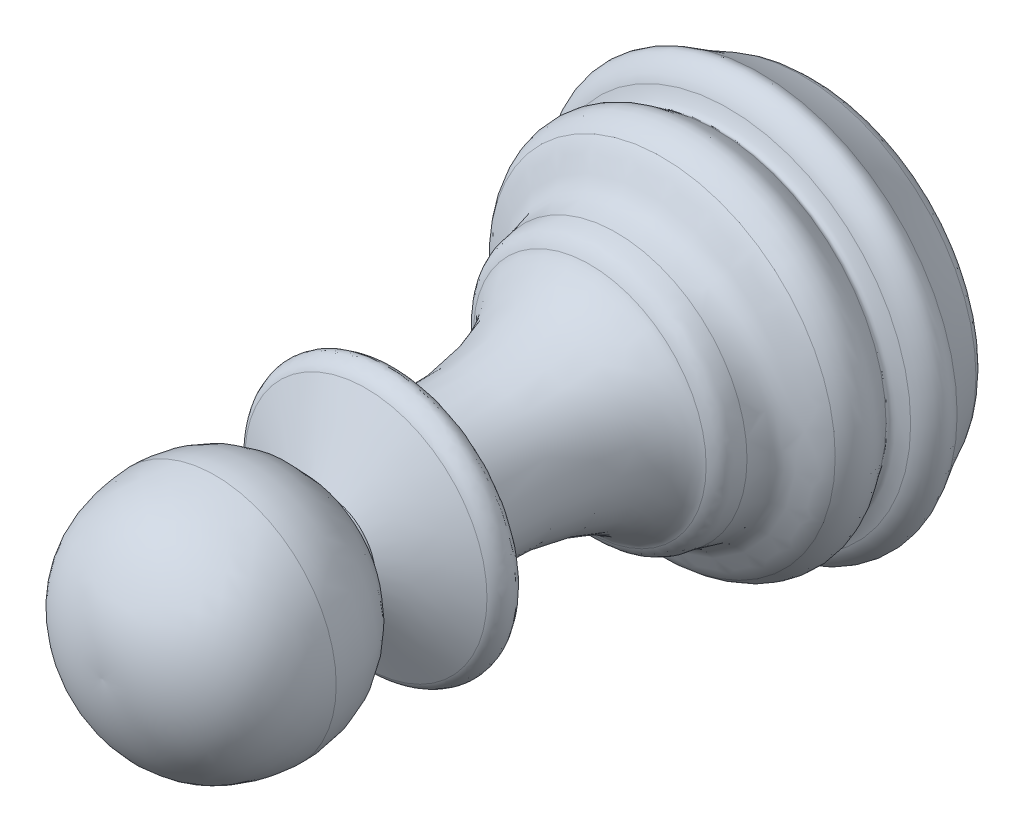
ISO-10303-21;
HEADER;
FILE_DESCRIPTION(('STEP AP214'),'2;1');
FILE_NAME('part.step','',(''),(''),'','','');
FILE_SCHEMA(('AUTOMOTIVE_DESIGN { 1 0 10303 214 1 1 1 1 }'));
ENDSEC;
DATA;
#1=APPLICATION_CONTEXT('core data for automotive mechanical design processes');
#2=APPLICATION_PROTOCOL_DEFINITION('international standard','automotive_design',2000,#1);
#3=PRODUCT_CONTEXT('',#1,'mechanical');
#4=PRODUCT('Part','Part','',(#3));
#5=PRODUCT_RELATED_PRODUCT_CATEGORY('part','',(#4));
#6=PRODUCT_DEFINITION_FORMATION('','',#4);
#7=PRODUCT_DEFINITION_CONTEXT('part definition',#1,'design');
#8=PRODUCT_DEFINITION('design','',#6,#7);
#9=PRODUCT_DEFINITION_SHAPE('','',#8);
#10=(LENGTH_UNIT() NAMED_UNIT(*) SI_UNIT(.MILLI.,.METRE.));
#11=(NAMED_UNIT(*) PLANE_ANGLE_UNIT() SI_UNIT($,.RADIAN.));
#12=(NAMED_UNIT(*) SI_UNIT($,.STERADIAN.) SOLID_ANGLE_UNIT());
#13=UNCERTAINTY_MEASURE_WITH_UNIT(LENGTH_MEASURE(1.E-05),#10,'distance_accuracy_value','');
#14=(GEOMETRIC_REPRESENTATION_CONTEXT(3) GLOBAL_UNCERTAINTY_ASSIGNED_CONTEXT((#13)) GLOBAL_UNIT_ASSIGNED_CONTEXT((#10,
#11,#12)) REPRESENTATION_CONTEXT('',''));
#15=CARTESIAN_POINT('',(0.,0.,0.));
#16=DIRECTION('',(0.,0.,1.));
#17=DIRECTION('',(1.,0.,0.));
#18=AXIS2_PLACEMENT_3D('',#15,#16,#17);
#19=CARTESIAN_POINT('',(0.,0.,0.));
#20=DIRECTION('',(0.,0.,1.));
#21=DIRECTION('',(1.,0.,0.));
#22=AXIS2_PLACEMENT_3D('',#19,#20,#21);
#23=PLANE('',#22);
#24=CARTESIAN_POINT('',(0.,0.,0.));
#25=DIRECTION('',(0.,0.,1.));
#26=DIRECTION('',(1.,0.,0.));
#27=AXIS2_PLACEMENT_3D('',#24,#25,#26);
#28=CIRCLE('',#27,5.54380540900091);
#29=CARTESIAN_POINT('',(5.54380540900091,0.,0.));
#30=VERTEX_POINT('',#29);
#31=EDGE_CURVE('E89',#30,#30,#28,.T.);
#32=ORIENTED_EDGE('',*,*,#31,.F.);
#33=EDGE_LOOP('',(#32));
#34=FACE_BOUND('',#33,.T.);
#35=ADVANCED_FACE('F33',(#34),#23,.F.);
#36=CARTESIAN_POINT('',(0.,-5.54380540900091,0.));
#37=CARTESIAN_POINT('',(0.,-6.88930220512461,0.686287117591929));
#38=CARTESIAN_POINT('',(0.,-6.31979329640109,1.52584767701262));
#39=B_SPLINE_CURVE_WITH_KNOTS('',2,(#36,#37,#38),.UNSPECIFIED.,.F.,.F.,(3,3),(0.,1.),.UNSPECIFIED.);
#40=CARTESIAN_POINT('',(0.,0.,26.6250714661388));
#41=DIRECTION('',(0.,0.,1.));
#42=AXIS1_PLACEMENT('',#40,#41);
#43=SURFACE_OF_REVOLUTION('',#39,#42);
#44=CARTESIAN_POINT('',(0.,0.,0.741248163644646));
#45=DIRECTION('',(0.,0.,1.));
#46=DIRECTION('',(1.,0.,0.));
#47=AXIS2_PLACEMENT_3D('',#44,#45,#46);
#48=CIRCLE('',#47,6.41877803695931);
#49=CARTESIAN_POINT('',(6.41877803695931,0.,0.741248163644646));
#50=VERTEX_POINT('',#49);
#51=EDGE_CURVE('E11',#50,#50,#48,.F.);
#52=ORIENTED_EDGE('',*,*,#51,.T.);
#53=EDGE_LOOP('',(#52));
#54=FACE_BOUND('',#53,.T.);
#55=ORIENTED_EDGE('',*,*,#31,.T.);
#56=EDGE_LOOP('',(#55));
#57=FACE_BOUND('',#56,.T.);
#58=ADVANCED_FACE('F103',(#54,#57),#43,.T.);
#59=CARTESIAN_POINT('',(0.,-7.08530775393653,2.05559233845546));
#60=CARTESIAN_POINT('',(0.,-7.5394105595259,2.52005985615532));
#61=CARTESIAN_POINT('',(0.,-7.40122549000943,3.03910509027459));
#62=CARTESIAN_POINT('',(0.,-6.97071058936282,3.39104928563491));
#63=CARTESIAN_POINT('',(0.,-6.74136266093906,3.4784528915882));
#64=B_SPLINE_CURVE_WITH_KNOTS('',3,(#59,#60,#61,#62,#63),.UNSPECIFIED.,.F.,.F.,(4,1,4),(0.,
0.627277691643805,1.),.UNSPECIFIED.);
#65=CARTESIAN_POINT('',(0.,0.,26.6250714661388));
#66=DIRECTION('',(0.,0.,1.));
#67=AXIS1_PLACEMENT('',#65,#66);
#68=SURFACE_OF_REVOLUTION('',#64,#67);
#69=CARTESIAN_POINT('',(0.,0.,2.30597722885203));
#70=DIRECTION('',(0.,0.,1.));
#71=DIRECTION('',(1.,0.,0.));
#72=AXIS2_PLACEMENT_3D('',#69,#70,#71);
#73=CIRCLE('',#72,7.28861300832227);
#74=CARTESIAN_POINT('',(7.28861300832227,0.,2.30597722885203));
#75=VERTEX_POINT('',#74);
#76=EDGE_CURVE('E40',#75,#75,#73,.T.);
#77=ORIENTED_EDGE('',*,*,#76,.T.);
#78=EDGE_LOOP('',(#77));
#79=FACE_BOUND('',#78,.T.);
#80=CARTESIAN_POINT('',(0.,0.,3.4784528915882));
#81=DIRECTION('',(0.,0.,1.));
#82=DIRECTION('',(1.,0.,0.));
#83=AXIS2_PLACEMENT_3D('',#80,#81,#82);
#84=CIRCLE('',#83,6.74136266093906);
#85=CARTESIAN_POINT('',(6.74136266093906,0.,3.4784528915882));
#86=VERTEX_POINT('',#85);
#87=EDGE_CURVE('E86',#86,#86,#84,.T.);
#88=ORIENTED_EDGE('',*,*,#87,.F.);
#89=EDGE_LOOP('',(#88));
#90=FACE_BOUND('',#89,.T.);
#91=ADVANCED_FACE('F94',(#79,#90),#68,.T.);
#92=CARTESIAN_POINT('',(0.,-6.74136266093906,3.4784528915882));
#93=CARTESIAN_POINT('',(0.,-6.69003413724891,3.4980139928792));
#94=CARTESIAN_POINT('',(0.,-6.44510057926217,3.57334142751363));
#95=CARTESIAN_POINT('',(0.,-6.18394133438702,3.71775467280206));
#96=CARTESIAN_POINT('',(0.,-6.21872337618383,3.85525833890696));
#97=CARTESIAN_POINT('',(0.,-6.2477493248012,3.8978605653888));
#98=B_SPLINE_CURVE_WITH_KNOTS('',3,(#92,#93,#94,#95,#96,#97),.UNSPECIFIED.,.F.,.F.,(4,1,1,4),
(0.,0.415653946765478,0.837633487147216,1.),.UNSPECIFIED.);
#99=CARTESIAN_POINT('',(0.,0.,26.6250714661388));
#100=DIRECTION('',(0.,0.,1.));
#101=AXIS1_PLACEMENT('',#99,#100);
#102=SURFACE_OF_REVOLUTION('',#98,#101);
#103=CARTESIAN_POINT('',(0.,0.,3.8978605653888));
#104=DIRECTION('',(0.,0.,1.));
#105=DIRECTION('',(1.,0.,0.));
#106=AXIS2_PLACEMENT_3D('',#103,#104,#105);
#107=CIRCLE('',#106,6.2477493248012);
#108=CARTESIAN_POINT('',(6.2477493248012,0.,3.8978605653888));
#109=VERTEX_POINT('',#108);
#110=EDGE_CURVE('E83',#109,#109,#107,.T.);
#111=ORIENTED_EDGE('',*,*,#110,.F.);
#112=EDGE_LOOP('',(#111));
#113=FACE_BOUND('',#112,.T.);
#114=ORIENTED_EDGE('',*,*,#87,.T.);
#115=EDGE_LOOP('',(#114));
#116=FACE_BOUND('',#115,.T.);
#117=ADVANCED_FACE('F139',(#113,#116),#102,.T.);
#118=CARTESIAN_POINT('',(0.,-6.2477493248012,3.8978605653888));
#119=CARTESIAN_POINT('',(0.,-6.42633458869202,4.15997533582711));
#120=CARTESIAN_POINT('',(0.,-6.95166145899549,4.72818720175668));
#121=CARTESIAN_POINT('',(0.,-6.78417767732987,5.53134390215841));
#122=CARTESIAN_POINT('',(0.,-6.40240179389252,5.93019073502738));
#123=B_SPLINE_CURVE_WITH_KNOTS('',3,(#118,#119,#120,#121,#122),.UNSPECIFIED.,.F.,.F.,(4,1,4),
(0.,0.411498427605865,1.),.UNSPECIFIED.);
#124=CARTESIAN_POINT('',(0.,0.,26.6250714661388));
#125=DIRECTION('',(0.,0.,1.));
#126=AXIS1_PLACEMENT('',#124,#125);
#127=SURFACE_OF_REVOLUTION('',#123,#126);
#128=CARTESIAN_POINT('',(0.,0.,5.93019073502738));
#129=DIRECTION('',(0.,0.,1.));
#130=DIRECTION('',(1.,0.,0.));
#131=AXIS2_PLACEMENT_3D('',#128,#129,#130);
#132=CIRCLE('',#131,6.40240179389252);
#133=CARTESIAN_POINT('',(6.40240179389252,0.,5.93019073502738));
#134=VERTEX_POINT('',#133);
#135=EDGE_CURVE('E80',#134,#134,#132,.T.);
#136=ORIENTED_EDGE('',*,*,#135,.F.);
#137=EDGE_LOOP('',(#136));
#138=FACE_BOUND('',#137,.T.);
#139=ORIENTED_EDGE('',*,*,#110,.T.);
#140=EDGE_LOOP('',(#139));
#141=FACE_BOUND('',#140,.T.);
#142=ADVANCED_FACE('F142',(#138,#141),#127,.T.);
#143=CARTESIAN_POINT('',(0.,-6.40240179389252,5.93019073502738));
#144=CARTESIAN_POINT('',(0.,-6.00702161096956,6.34325017796062));
#145=CARTESIAN_POINT('',(0.,-5.10904880247781,6.44918911727253));
#146=CARTESIAN_POINT('',(0.,-4.87471836286527,7.30367231987795));
#147=CARTESIAN_POINT('',(0.,-4.83396756140255,7.62524934257052));
#148=B_SPLINE_CURVE_WITH_KNOTS('',3,(#143,#144,#145,#146,#147),.UNSPECIFIED.,.F.,.F.,(4,1,4),
(0.,0.622355002363214,1.),.UNSPECIFIED.);
#149=CARTESIAN_POINT('',(0.,0.,26.6250714661388));
#150=DIRECTION('',(0.,0.,1.));
#151=AXIS1_PLACEMENT('',#149,#150);
#152=SURFACE_OF_REVOLUTION('',#148,#151);
#153=CARTESIAN_POINT('',(0.,0.,7.62524934257052));
#154=DIRECTION('',(0.,0.,1.));
#155=DIRECTION('',(1.,0.,0.));
#156=AXIS2_PLACEMENT_3D('',#153,#154,#155);
#157=CIRCLE('',#156,4.83396756140255);
#158=CARTESIAN_POINT('',(4.83396756140255,0.,7.62524934257052));
#159=VERTEX_POINT('',#158);
#160=EDGE_CURVE('E77',#159,#159,#157,.T.);
#161=ORIENTED_EDGE('',*,*,#160,.F.);
#162=EDGE_LOOP('',(#161));
#163=FACE_BOUND('',#162,.T.);
#164=ORIENTED_EDGE('',*,*,#135,.T.);
#165=EDGE_LOOP('',(#164));
#166=FACE_BOUND('',#165,.T.);
#167=ADVANCED_FACE('F146',(#163,#166),#152,.T.);
#168=CARTESIAN_POINT('',(0.,-4.83396756140255,7.62524934257052));
#169=CARTESIAN_POINT('',(0.,-4.79990028539568,7.89408462424114));
#170=CARTESIAN_POINT('',(0.,-4.77873853692175,8.27593085338218));
#171=CARTESIAN_POINT('',(0.,-4.4596526335504,8.52480310345291));
#172=CARTESIAN_POINT('',(0.,-4.30193153105819,8.60490251250283));
#173=B_SPLINE_CURVE_WITH_KNOTS('',3,(#168,#169,#170,#171,#172),.UNSPECIFIED.,.F.,.F.,(4,1,4),
(0.,0.591594304790621,1.),.UNSPECIFIED.);
#174=CARTESIAN_POINT('',(0.,0.,26.6250714661388));
#175=DIRECTION('',(0.,0.,1.));
#176=AXIS1_PLACEMENT('',#174,#175);
#177=SURFACE_OF_REVOLUTION('',#173,#176);
#178=CARTESIAN_POINT('',(0.,0.,8.60490251250283));
#179=DIRECTION('',(0.,0.,1.));
#180=DIRECTION('',(1.,0.,0.));
#181=AXIS2_PLACEMENT_3D('',#178,#179,#180);
#182=CIRCLE('',#181,4.30193153105819);
#183=CARTESIAN_POINT('',(4.30193153105819,0.,8.60490251250283));
#184=VERTEX_POINT('',#183);
#185=EDGE_CURVE('E74',#184,#184,#182,.T.);
#186=ORIENTED_EDGE('',*,*,#185,.F.);
#187=EDGE_LOOP('',(#186));
#188=FACE_BOUND('',#187,.T.);
#189=ORIENTED_EDGE('',*,*,#160,.T.);
#190=EDGE_LOOP('',(#189));
#191=FACE_BOUND('',#190,.T.);
#192=ADVANCED_FACE('F150',(#188,#191),#177,.T.);
#193=CARTESIAN_POINT('',(0.,-4.30193153105819,8.60490251250283));
#194=CARTESIAN_POINT('',(0.,-3.71613185929674,8.90240365083052));
#195=CARTESIAN_POINT('',(0.,-2.13635684011027,11.1362757648571));
#196=CARTESIAN_POINT('',(0.,-2.73585294150847,15.6896951188552));
#197=B_SPLINE_CURVE_WITH_KNOTS('',3,(#193,#194,#195,#196),.UNSPECIFIED.,.F.,.F.,(4,4),(0.,1.),.UNSPECIFIED.);
#198=CARTESIAN_POINT('',(0.,0.,26.6250714661388));
#199=DIRECTION('',(0.,0.,1.));
#200=AXIS1_PLACEMENT('',#198,#199);
#201=SURFACE_OF_REVOLUTION('',#197,#200);
#202=CARTESIAN_POINT('',(0.,0.,15.6896951188552));
#203=DIRECTION('',(0.,0.,1.));
#204=DIRECTION('',(1.,0.,0.));
#205=AXIS2_PLACEMENT_3D('',#202,#203,#204);
#206=CIRCLE('',#205,2.73585294150847);
#207=CARTESIAN_POINT('',(2.73585294150847,0.,15.6896951188552));
#208=VERTEX_POINT('',#207);
#209=EDGE_CURVE('E71',#208,#208,#206,.T.);
#210=ORIENTED_EDGE('',*,*,#209,.F.);
#211=EDGE_LOOP('',(#210));
#212=FACE_BOUND('',#211,.T.);
#213=ORIENTED_EDGE('',*,*,#185,.T.);
#214=EDGE_LOOP('',(#213));
#215=FACE_BOUND('',#214,.T.);
#216=ADVANCED_FACE('F177',(#212,#215),#201,.T.);
#217=CARTESIAN_POINT('',(0.,-4.14677425575863,15.6896951188552));
#218=DIRECTION('',(0.,0.,1.));
#219=DIRECTION('',(1.,0.,0.));
#220=AXIS2_PLACEMENT_3D('',#217,#218,#219);
#221=PLANE('',#220);
#222=CARTESIAN_POINT('',(0.,0.,15.6896951188552));
#223=DIRECTION('',(0.,0.,1.));
#224=DIRECTION('',(1.,0.,0.));
#225=AXIS2_PLACEMENT_3D('',#222,#223,#224);
#226=CIRCLE('',#225,4.14677425575863);
#227=CARTESIAN_POINT('',(4.14677425575863,0.,15.6896951188552));
#228=VERTEX_POINT('',#227);
#229=EDGE_CURVE('E68',#228,#228,#226,.T.);
#230=ORIENTED_EDGE('',*,*,#229,.F.);
#231=EDGE_LOOP('',(#230));
#232=FACE_BOUND('',#231,.T.);
#233=ORIENTED_EDGE('',*,*,#209,.T.);
#234=EDGE_LOOP('',(#233));
#235=FACE_BOUND('',#234,.T.);
#236=ADVANCED_FACE('F180',(#232,#235),#221,.F.);
#237=CARTESIAN_POINT('',(0.,-4.14677425575863,15.6896951188552));
#238=CARTESIAN_POINT('',(0.,-4.49349374576997,15.6896951188552));
#239=CARTESIAN_POINT('',(0.,-5.06720298584773,16.1640499555581));
#240=CARTESIAN_POINT('',(0.,-4.67949812577122,16.786031006644));
#241=CARTESIAN_POINT('',(0.,-4.47900137598499,16.8884423972514));
#242=B_SPLINE_CURVE_WITH_KNOTS('',3,(#237,#238,#239,#240,#241),.UNSPECIFIED.,.F.,.F.,(4,1,4),
(0.,0.552532558306121,1.),.UNSPECIFIED.);
#243=CARTESIAN_POINT('',(0.,0.,26.6250714661388));
#244=DIRECTION('',(0.,0.,1.));
#245=AXIS1_PLACEMENT('',#243,#244);
#246=SURFACE_OF_REVOLUTION('',#242,#245);
#247=CARTESIAN_POINT('',(0.,0.,16.8884423972514));
#248=DIRECTION('',(0.,0.,1.));
#249=DIRECTION('',(1.,0.,0.));
#250=AXIS2_PLACEMENT_3D('',#247,#248,#249);
#251=CIRCLE('',#250,4.47900137598499);
#252=CARTESIAN_POINT('',(4.47900137598499,0.,16.8884423972514));
#253=VERTEX_POINT('',#252);
#254=EDGE_CURVE('E65',#253,#253,#251,.T.);
#255=ORIENTED_EDGE('',*,*,#254,.F.);
#256=EDGE_LOOP('',(#255));
#257=FACE_BOUND('',#256,.T.);
#258=ORIENTED_EDGE('',*,*,#229,.T.);
#259=EDGE_LOOP('',(#258));
#260=FACE_BOUND('',#259,.T.);
#261=ADVANCED_FACE('F184',(#257,#260),#246,.T.);
#262=CARTESIAN_POINT('',(0.,0.,16.8884423972514));
#263=DIRECTION('',(0.,0.,-1.));
#264=DIRECTION('',(-1.,0.,0.));
#265=AXIS2_PLACEMENT_3D('',#262,#263,#264);
#266=CONICAL_SURFACE('',#265,4.47900137598499,1.09855538660732);
#267=CARTESIAN_POINT('',(0.,0.,18.2828964989648));
#268=DIRECTION('',(0.,0.,1.));
#269=DIRECTION('',(1.,0.,0.));
#270=AXIS2_PLACEMENT_3D('',#267,#268,#269);
#271=CIRCLE('',#270,1.74899728697379);
#272=CARTESIAN_POINT('',(1.74899728697379,0.,18.2828964989648));
#273=VERTEX_POINT('',#272);
#274=EDGE_CURVE('E55',#273,#273,#271,.T.);
#275=ORIENTED_EDGE('',*,*,#274,.F.);
#276=EDGE_LOOP('',(#275));
#277=FACE_BOUND('',#276,.T.);
#278=ORIENTED_EDGE('',*,*,#254,.T.);
#279=EDGE_LOOP('',(#278));
#280=FACE_BOUND('',#279,.T.);
#281=ADVANCED_FACE('F188',(#277,#280),#266,.T.);
#282=CARTESIAN_POINT('',(0.,0.,26.6250714661388));
#283=DIRECTION('',(0.,0.,1.));
#284=DIRECTION('',(1.,0.,0.));
#285=AXIS2_PLACEMENT_3D('',#282,#283,#284);
#286=CYLINDRICAL_SURFACE('',#285,1.74899728697378);
#287=CARTESIAN_POINT('',(0.,0.,18.5191006817314));
#288=DIRECTION('',(0.,0.,1.));
#289=DIRECTION('',(1.,0.,0.));
#290=AXIS2_PLACEMENT_3D('',#287,#288,#289);
#291=CIRCLE('',#290,1.74899728697378);
#292=CARTESIAN_POINT('',(1.74899728697378,0.,18.5191006817314));
#293=VERTEX_POINT('',#292);
#294=EDGE_CURVE('E52',#293,#293,#291,.T.);
#295=ORIENTED_EDGE('',*,*,#294,.F.);
#296=EDGE_LOOP('',(#295));
#297=FACE_BOUND('',#296,.T.);
#298=ORIENTED_EDGE('',*,*,#274,.T.);
#299=EDGE_LOOP('',(#298));
#300=FACE_BOUND('',#299,.T.);
#301=ADVANCED_FACE('F192',(#297,#300),#286,.T.);
#302=CARTESIAN_POINT('',(0.,-1.74899728697378,18.5191006817314));
#303=CARTESIAN_POINT('',(0.,-4.4933357437564,19.72471462376));
#304=CARTESIAN_POINT('',(0.,-4.47900137598499,22.4655527855376));
#305=B_SPLINE_CURVE_WITH_KNOTS('',2,(#302,#303,#304),.UNSPECIFIED.,.F.,.F.,(3,3),(0.,1.),.UNSPECIFIED.);
#306=CARTESIAN_POINT('',(0.,0.,26.6250714661388));
#307=DIRECTION('',(0.,0.,1.));
#308=AXIS1_PLACEMENT('',#306,#307);
#309=SURFACE_OF_REVOLUTION('',#305,#308);
#310=CARTESIAN_POINT('',(0.,0.,22.4655527855376));
#311=DIRECTION('',(0.,0.,1.));
#312=DIRECTION('',(1.,0.,0.));
#313=AXIS2_PLACEMENT_3D('',#310,#311,#312);
#314=CIRCLE('',#313,4.479001375985);
#315=CARTESIAN_POINT('',(4.479001375985,0.,22.4655527855376));
#316=VERTEX_POINT('',#315);
#317=EDGE_CURVE('E50',#316,#316,#314,.T.);
#318=ORIENTED_EDGE('',*,*,#317,.F.);
#319=EDGE_LOOP('',(#318));
#320=FACE_BOUND('',#319,.T.);
#321=ORIENTED_EDGE('',*,*,#294,.T.);
#322=EDGE_LOOP('',(#321));
#323=FACE_BOUND('',#322,.T.);
#324=ADVANCED_FACE('F46',(#320,#323),#309,.T.);
#325=CARTESIAN_POINT('',(0.,-4.479001375985,22.4655527855376));
#326=CARTESIAN_POINT('',(0.,-4.41056249113169,23.5672746561115));
#327=CARTESIAN_POINT('',(0.,-3.7808345901192,25.7024440899064));
#328=CARTESIAN_POINT('',(0.,-1.26198279921926,26.7204481232485));
#329=CARTESIAN_POINT('',(0.,0.,26.6250714661388));
#330=B_SPLINE_CURVE_WITH_KNOTS('',3,(#325,#326,#327,#328,#329),.UNSPECIFIED.,.F.,.F.,(4,1,4),
(0.,0.421395919840445,1.),.UNSPECIFIED.);
#331=CARTESIAN_POINT('',(0.,0.,26.6250714661388));
#332=DIRECTION('',(0.,0.,1.));
#333=AXIS1_PLACEMENT('',#331,#332);
#334=SURFACE_OF_REVOLUTION('',#330,#333);
#335=CARTESIAN_POINT('',(0.,0.,26.6250714661388));
#336=VERTEX_POINT('',#335);
#337=VERTEX_LOOP('',#336);
#338=FACE_BOUND('',#337,.T.);
#339=ORIENTED_EDGE('',*,*,#317,.T.);
#340=EDGE_LOOP('',(#339));
#341=FACE_BOUND('',#340,.T.);
#342=ADVANCED_FACE('F43',(#338,#341),#334,.T.);
#343=CARTESIAN_POINT('',(0.,0.,-5.75150671192007));
#344=DIRECTION('',(0.,0.,1.));
#345=DIRECTION('',(1.,0.,0.));
#346=AXIS2_PLACEMENT_3D('',#343,#344,#345);
#347=TOROIDAL_SURFACE('',#346,19.9407650997334,15.);
#348=ORIENTED_EDGE('',*,*,#51,.F.);
#349=EDGE_LOOP('',(#348));
#350=FACE_BOUND('',#349,.T.);
#351=ORIENTED_EDGE('',*,*,#76,.F.);
#352=EDGE_LOOP('',(#351));
#353=FACE_BOUND('',#352,.T.);
#354=ADVANCED_FACE('F35',(#350,#353),#347,.F.);
#355=CLOSED_SHELL('',(#35,#58,#91,#117,#142,#167,#192,#216,#236,#261,#281,#301,#324,#342,#354));
#356=MANIFOLD_SOLID_BREP('B2',#355);
#357=ADVANCED_BREP_SHAPE_REPRESENTATION('',(#18,#356),#14);
#358=SHAPE_DEFINITION_REPRESENTATION(#9,#357);
ENDSEC;
END-ISO-10303-21;
